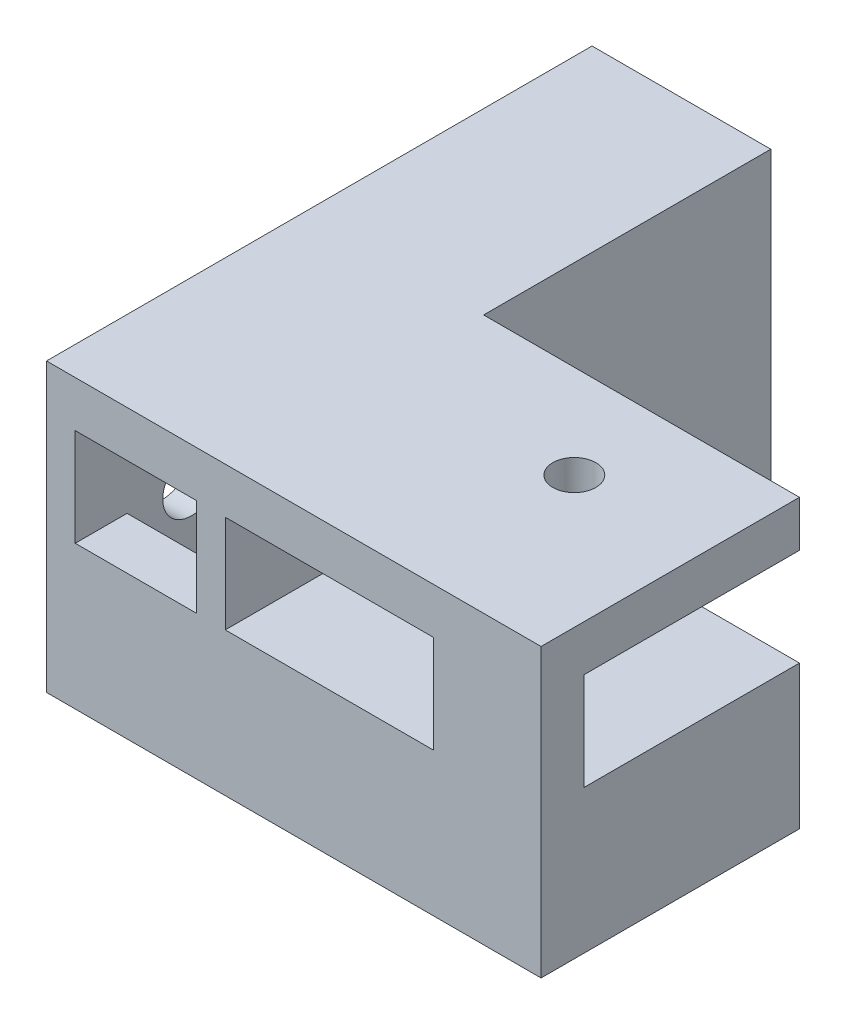
ISO-10303-21;
HEADER;
FILE_DESCRIPTION(('STEP AP214'),'2;1');
FILE_NAME('part.step','',(''),(''),'','','');
FILE_SCHEMA(('AUTOMOTIVE_DESIGN { 1 0 10303 214 1 1 1 1 }'));
ENDSEC;
DATA;
#1=APPLICATION_CONTEXT('core data for automotive mechanical design processes');
#2=APPLICATION_PROTOCOL_DEFINITION('international standard','automotive_design',2000,#1);
#3=PRODUCT_CONTEXT('',#1,'mechanical');
#4=PRODUCT('Part','Part','',(#3));
#5=PRODUCT_RELATED_PRODUCT_CATEGORY('part','',(#4));
#6=PRODUCT_DEFINITION_FORMATION('','',#4);
#7=PRODUCT_DEFINITION_CONTEXT('part definition',#1,'design');
#8=PRODUCT_DEFINITION('design','',#6,#7);
#9=PRODUCT_DEFINITION_SHAPE('','',#8);
#10=(LENGTH_UNIT() NAMED_UNIT(*) SI_UNIT(.MILLI.,.METRE.));
#11=(NAMED_UNIT(*) PLANE_ANGLE_UNIT() SI_UNIT($,.RADIAN.));
#12=(NAMED_UNIT(*) SI_UNIT($,.STERADIAN.) SOLID_ANGLE_UNIT());
#13=UNCERTAINTY_MEASURE_WITH_UNIT(LENGTH_MEASURE(1.E-05),#10,'distance_accuracy_value','');
#14=(GEOMETRIC_REPRESENTATION_CONTEXT(3) GLOBAL_UNCERTAINTY_ASSIGNED_CONTEXT((#13)) GLOBAL_UNIT_ASSIGNED_CONTEXT((#10,
#11,#12)) REPRESENTATION_CONTEXT('',''));
#15=CARTESIAN_POINT('',(0.,0.,0.));
#16=DIRECTION('',(0.,0.,1.));
#17=DIRECTION('',(1.,0.,0.));
#18=AXIS2_PLACEMENT_3D('',#15,#16,#17);
#19=CARTESIAN_POINT('',(0.,5.,-18.));
#20=DIRECTION('',(0.,1.,0.));
#21=DIRECTION('',(0.,0.,1.));
#22=AXIS2_PLACEMENT_3D('',#19,#20,#21);
#23=PLANE('',#22);
#24=DIRECTION('',(-1.,0.,0.));
#25=VECTOR('',#24,1.);
#26=CARTESIAN_POINT('',(0.,5.,-15.9436413169626));
#27=LINE('',#26,#25);
#28=CARTESIAN_POINT('',(-4.375,4.99999999986514,-15.9436413171899));
#29=VERTEX_POINT('',#28);
#30=CARTESIAN_POINT('',(-12.825,4.99999999995493,-15.9436413170386));
#31=VERTEX_POINT('',#30);
#32=EDGE_CURVE('E281',#29,#31,#27,.T.);
#33=ORIENTED_EDGE('',*,*,#32,.F.);
#34=DIRECTION('',(0.,0.,1.));
#35=VECTOR('',#34,1.);
#36=CARTESIAN_POINT('',(-4.37500000000001,5.,-38.));
#37=LINE('',#36,#35);
#38=CARTESIAN_POINT('',(-4.375,5.,-38.));
#39=VERTEX_POINT('',#38);
#40=EDGE_CURVE('E252',#39,#29,#37,.T.);
#41=ORIENTED_EDGE('',*,*,#40,.F.);
#42=DIRECTION('',(-1.,0.,0.));
#43=VECTOR('',#42,1.);
#44=CARTESIAN_POINT('',(0.,5.,-38.));
#45=LINE('',#44,#43);
#46=CARTESIAN_POINT('',(-12.825,5.,-38.));
#47=VERTEX_POINT('',#46);
#48=EDGE_CURVE('E453',#39,#47,#45,.T.);
#49=ORIENTED_EDGE('',*,*,#48,.T.);
#50=DIRECTION('',(0.,0.,-1.));
#51=VECTOR('',#50,1.);
#52=CARTESIAN_POINT('',(-12.825,5.,-38.));
#53=LINE('',#52,#51);
#54=EDGE_CURVE('E314',#31,#47,#53,.T.);
#55=ORIENTED_EDGE('',*,*,#54,.F.);
#56=EDGE_LOOP('',(#33,#41,#49,#55));
#57=FACE_BOUND('',#56,.T.);
#58=ADVANCED_FACE('F40',(#57),#23,.T.);
#59=CARTESIAN_POINT('',(10.44201924,5.,-11.5));
#60=DIRECTION('',(0.,1.,0.));
#61=DIRECTION('',(0.,0.,1.));
#62=AXIS2_PLACEMENT_3D('',#59,#60,#61);
#63=CIRCLE('',#62,1.5);
#64=CARTESIAN_POINT('',(10.44201924,5.,-10.));
#65=VERTEX_POINT('',#64);
#66=EDGE_CURVE('E401',#65,#65,#63,.F.);
#67=ORIENTED_EDGE('',*,*,#66,.T.);
#68=EDGE_LOOP('',(#67));
#69=FACE_BOUND('',#68,.T.);
#70=DIRECTION('',(0.,0.,1.));
#71=VECTOR('',#70,1.);
#72=CARTESIAN_POINT('',(12.125,4.99999999999545,0.));
#73=LINE('',#72,#71);
#74=CARTESIAN_POINT('',(12.125,4.99999999999545,-3.));
#75=VERTEX_POINT('',#74);
#76=CARTESIAN_POINT('',(12.125,4.99999999999545,0.));
#77=VERTEX_POINT('',#76);
#78=EDGE_CURVE('E311',#75,#77,#73,.T.);
#79=ORIENTED_EDGE('',*,*,#78,.F.);
#80=DIRECTION('',(-1.,0.,0.));
#81=VECTOR('',#80,1.);
#82=CARTESIAN_POINT('',(19.625,4.99999999999545,-3.));
#83=LINE('',#82,#81);
#84=CARTESIAN_POINT('',(19.625,4.99999999999545,-3.));
#85=VERTEX_POINT('',#84);
#86=EDGE_CURVE('E308',#85,#75,#83,.T.);
#87=ORIENTED_EDGE('',*,*,#86,.F.);
#88=DIRECTION('',(0.,0.,1.));
#89=VECTOR('',#88,1.);
#90=CARTESIAN_POINT('',(19.625,5.,0.));
#91=LINE('',#90,#89);
#92=CARTESIAN_POINT('',(19.625,5.,-18.));
#93=VERTEX_POINT('',#92);
#94=EDGE_CURVE('E417',#93,#85,#91,.T.);
#95=ORIENTED_EDGE('',*,*,#94,.F.);
#96=DIRECTION('',(-1.,0.,0.));
#97=VECTOR('',#96,1.);
#98=CARTESIAN_POINT('',(0.,5.,-18.));
#99=LINE('',#98,#97);
#100=CARTESIAN_POINT('',(-2.375,5.,-18.));
#101=VERTEX_POINT('',#100);
#102=EDGE_CURVE('E641',#93,#101,#99,.T.);
#103=ORIENTED_EDGE('',*,*,#102,.T.);
#104=DIRECTION('',(0.,0.,-1.));
#105=VECTOR('',#104,1.);
#106=CARTESIAN_POINT('',(-2.37500000000001,5.,-38.));
#107=LINE('',#106,#105);
#108=CARTESIAN_POINT('',(-2.375,5.,0.));
#109=VERTEX_POINT('',#108);
#110=EDGE_CURVE('E392',#109,#101,#107,.T.);
#111=ORIENTED_EDGE('',*,*,#110,.F.);
#112=DIRECTION('',(-1.,0.,0.));
#113=VECTOR('',#112,1.);
#114=CARTESIAN_POINT('',(0.,5.,0.));
#115=LINE('',#114,#113);
#116=EDGE_CURVE('E651',#77,#109,#115,.T.);
#117=ORIENTED_EDGE('',*,*,#116,.F.);
#118=EDGE_LOOP('',(#79,#87,#95,#103,#111,#117));
#119=FACE_BOUND('',#118,.T.);
#120=ADVANCED_FACE('F513',(#69,#119),#23,.T.);
#121=CARTESIAN_POINT('',(0.,11.8,-18.));
#122=DIRECTION('',(0.,1.,0.));
#123=DIRECTION('',(0.,0.,1.));
#124=AXIS2_PLACEMENT_3D('',#121,#122,#123);
#125=PLANE('',#124);
#126=CARTESIAN_POINT('',(10.44201924,11.8,-11.5));
#127=DIRECTION('',(0.,1.,0.));
#128=DIRECTION('',(0.,0.,1.));
#129=AXIS2_PLACEMENT_3D('',#126,#127,#128);
#130=CIRCLE('',#129,1.5);
#131=CARTESIAN_POINT('',(10.44201924,11.8,-10.));
#132=VERTEX_POINT('',#131);
#133=EDGE_CURVE('E333',#132,#132,#130,.F.);
#134=ORIENTED_EDGE('',*,*,#133,.F.);
#135=EDGE_LOOP('',(#134));
#136=FACE_BOUND('',#135,.T.);
#137=DIRECTION('',(1.,0.,0.));
#138=VECTOR('',#137,1.);
#139=CARTESIAN_POINT('',(19.625,11.8,-3.));
#140=LINE('',#139,#138);
#141=CARTESIAN_POINT('',(12.125,11.8,-3.));
#142=VERTEX_POINT('',#141);
#143=CARTESIAN_POINT('',(19.625,11.8,-3.));
#144=VERTEX_POINT('',#143);
#145=EDGE_CURVE('E62',#142,#144,#140,.T.);
#146=ORIENTED_EDGE('',*,*,#145,.F.);
#147=DIRECTION('',(0.,0.,-1.));
#148=VECTOR('',#147,1.);
#149=CARTESIAN_POINT('',(12.125,11.8,0.));
#150=LINE('',#149,#148);
#151=CARTESIAN_POINT('',(12.125,11.8,0.));
#152=VERTEX_POINT('',#151);
#153=EDGE_CURVE('E293',#152,#142,#150,.T.);
#154=ORIENTED_EDGE('',*,*,#153,.F.);
#155=DIRECTION('',(-1.,0.,0.));
#156=VECTOR('',#155,1.);
#157=CARTESIAN_POINT('',(0.,11.8,0.));
#158=LINE('',#157,#156);
#159=CARTESIAN_POINT('',(-2.375,11.7999999999938,0.));
#160=VERTEX_POINT('',#159);
#161=EDGE_CURVE('E600',#152,#160,#158,.T.);
#162=ORIENTED_EDGE('',*,*,#161,.T.);
#163=DIRECTION('',(0.,0.,-1.));
#164=VECTOR('',#163,1.);
#165=CARTESIAN_POINT('',(-2.37500000000001,11.7999999999938,-38.));
#166=LINE('',#165,#164);
#167=CARTESIAN_POINT('',(-2.375,11.7999999999938,-18.));
#168=VERTEX_POINT('',#167);
#169=EDGE_CURVE('E375',#160,#168,#166,.T.);
#170=ORIENTED_EDGE('',*,*,#169,.T.);
#171=DIRECTION('',(-1.,0.,0.));
#172=VECTOR('',#171,1.);
#173=CARTESIAN_POINT('',(0.,11.8,-18.));
#174=LINE('',#173,#172);
#175=CARTESIAN_POINT('',(19.625,11.8,-18.));
#176=VERTEX_POINT('',#175);
#177=EDGE_CURVE('E599',#176,#168,#174,.T.);
#178=ORIENTED_EDGE('',*,*,#177,.F.);
#179=DIRECTION('',(0.,0.,-1.));
#180=VECTOR('',#179,1.);
#181=CARTESIAN_POINT('',(19.625,11.8,0.));
#182=LINE('',#181,#180);
#183=EDGE_CURVE('E337',#144,#176,#182,.T.);
#184=ORIENTED_EDGE('',*,*,#183,.F.);
#185=EDGE_LOOP('',(#146,#154,#162,#170,#178,#184));
#186=FACE_BOUND('',#185,.T.);
#187=ADVANCED_FACE('F517',(#136,#186),#125,.F.);
#188=DIRECTION('',(-1.,0.,0.));
#189=VECTOR('',#188,1.);
#190=CARTESIAN_POINT('',(11.4417453763892,5.,-3.61207246935829));
#191=LINE('',#190,#189);
#192=CARTESIAN_POINT('',(-12.825,5.,-3.61207246935829));
#193=VERTEX_POINT('',#192);
#194=CARTESIAN_POINT('',(-4.375,5.,-3.61207246935829));
#195=VERTEX_POINT('',#194);
#196=EDGE_CURVE('E278',#193,#195,#191,.F.);
#197=ORIENTED_EDGE('',*,*,#196,.F.);
#198=CARTESIAN_POINT('',(-12.825,5.,0.));
#199=VERTEX_POINT('',#198);
#200=EDGE_CURVE('E73',#199,#193,#53,.T.);
#201=ORIENTED_EDGE('',*,*,#200,.F.);
#202=CARTESIAN_POINT('',(-4.375,5.,0.));
#203=VERTEX_POINT('',#202);
#204=EDGE_CURVE('E462',#203,#199,#115,.T.);
#205=ORIENTED_EDGE('',*,*,#204,.F.);
#206=EDGE_CURVE('E44',#195,#203,#37,.T.);
#207=ORIENTED_EDGE('',*,*,#206,.F.);
#208=EDGE_LOOP('',(#197,#201,#205,#207));
#209=FACE_BOUND('',#208,.T.);
#210=ADVANCED_FACE('F42',(#209),#23,.T.);
#211=DIRECTION('',(0.,0.,-1.));
#212=VECTOR('',#211,1.);
#213=CARTESIAN_POINT('',(-12.825,11.7999999999938,-38.));
#214=LINE('',#213,#212);
#215=CARTESIAN_POINT('',(-12.825,11.7999999999938,0.));
#216=VERTEX_POINT('',#215);
#217=CARTESIAN_POINT('',(-12.825,11.7999999999938,-38.));
#218=VERTEX_POINT('',#217);
#219=EDGE_CURVE('E322',#216,#218,#214,.T.);
#220=ORIENTED_EDGE('',*,*,#219,.T.);
#221=DIRECTION('',(-1.,0.,0.));
#222=VECTOR('',#221,1.);
#223=CARTESIAN_POINT('',(0.,11.8,-38.));
#224=LINE('',#223,#222);
#225=CARTESIAN_POINT('',(-4.37500000000001,11.7999999999938,-38.));
#226=VERTEX_POINT('',#225);
#227=EDGE_CURVE('E348',#226,#218,#224,.T.);
#228=ORIENTED_EDGE('',*,*,#227,.F.);
#229=DIRECTION('',(0.,0.,1.));
#230=VECTOR('',#229,1.);
#231=CARTESIAN_POINT('',(-4.37500000000001,11.7999999999938,-38.));
#232=LINE('',#231,#230);
#233=CARTESIAN_POINT('',(-4.375,11.8,0.));
#234=VERTEX_POINT('',#233);
#235=EDGE_CURVE('E387',#226,#234,#232,.T.);
#236=ORIENTED_EDGE('',*,*,#235,.T.);
#237=EDGE_CURVE('E357',#234,#216,#158,.T.);
#238=ORIENTED_EDGE('',*,*,#237,.T.);
#239=EDGE_LOOP('',(#220,#228,#236,#238));
#240=FACE_BOUND('',#239,.T.);
#241=ADVANCED_FACE('F480',(#240),#125,.F.);
#242=CARTESIAN_POINT('',(0.,-2.,-38.));
#243=DIRECTION('',(0.,-1.,0.));
#244=DIRECTION('',(0.,0.,-1.));
#245=AXIS2_PLACEMENT_3D('',#242,#243,#244);
#246=PLANE('',#245);
#247=DIRECTION('',(0.,0.,1.));
#248=VECTOR('',#247,1.);
#249=CARTESIAN_POINT('',(-9.825,-2.,-38.));
#250=LINE('',#249,#248);
#251=CARTESIAN_POINT('',(-9.825,-2.,-38.));
#252=VERTEX_POINT('',#251);
#253=CARTESIAN_POINT('',(-9.825,-2.,-10.));
#254=VERTEX_POINT('',#253);
#255=EDGE_CURVE('E485',#252,#254,#250,.T.);
#256=ORIENTED_EDGE('',*,*,#255,.T.);
#257=DIRECTION('',(1.,0.,0.));
#258=VECTOR('',#257,1.);
#259=CARTESIAN_POINT('',(0.,-2.,-10.));
#260=LINE('',#259,#258);
#261=CARTESIAN_POINT('',(-14.825,-2.,-10.));
#262=VERTEX_POINT('',#261);
#263=EDGE_CURVE('E425',#262,#254,#260,.T.);
#264=ORIENTED_EDGE('',*,*,#263,.F.);
#265=DIRECTION('',(0.,0.,1.));
#266=VECTOR('',#265,1.);
#267=CARTESIAN_POINT('',(-14.825,-2.,-38.));
#268=LINE('',#267,#266);
#269=CARTESIAN_POINT('',(-14.825,-2.,-38.));
#270=VERTEX_POINT('',#269);
#271=EDGE_CURVE('E624',#270,#262,#268,.T.);
#272=ORIENTED_EDGE('',*,*,#271,.F.);
#273=DIRECTION('',(1.,0.,0.));
#274=VECTOR('',#273,1.);
#275=CARTESIAN_POINT('',(0.,-2.,-38.));
#276=LINE('',#275,#274);
#277=EDGE_CURVE('E439',#270,#252,#276,.T.);
#278=ORIENTED_EDGE('',*,*,#277,.T.);
#279=EDGE_LOOP('',(#256,#264,#272,#278));
#280=FACE_BOUND('',#279,.T.);
#281=ADVANCED_FACE('F524',(#280),#246,.T.);
#282=CARTESIAN_POINT('',(-9.825,0.,-38.));
#283=DIRECTION('',(-1.,0.,0.));
#284=DIRECTION('',(0.,0.,1.));
#285=AXIS2_PLACEMENT_3D('',#282,#283,#284);
#286=PLANE('',#285);
#287=DIRECTION('',(0.,0.,1.));
#288=VECTOR('',#287,1.);
#289=CARTESIAN_POINT('',(-9.825,-5.,-38.));
#290=LINE('',#289,#288);
#291=CARTESIAN_POINT('',(-9.825,-5.,-38.));
#292=VERTEX_POINT('',#291);
#293=CARTESIAN_POINT('',(-9.825,-5.,-10.));
#294=VERTEX_POINT('',#293);
#295=EDGE_CURVE('E487',#292,#294,#290,.T.);
#296=ORIENTED_EDGE('',*,*,#295,.T.);
#297=DIRECTION('',(0.,-1.,0.));
#298=VECTOR('',#297,1.);
#299=CARTESIAN_POINT('',(-9.825,0.,-10.));
#300=LINE('',#299,#298);
#301=EDGE_CURVE('E421',#254,#294,#300,.T.);
#302=ORIENTED_EDGE('',*,*,#301,.F.);
#303=ORIENTED_EDGE('',*,*,#255,.F.);
#304=DIRECTION('',(0.,-1.,0.));
#305=VECTOR('',#304,1.);
#306=CARTESIAN_POINT('',(-9.825,0.,-38.));
#307=LINE('',#306,#305);
#308=EDGE_CURVE('E443',#252,#292,#307,.T.);
#309=ORIENTED_EDGE('',*,*,#308,.T.);
#310=EDGE_LOOP('',(#296,#302,#303,#309));
#311=FACE_BOUND('',#310,.T.);
#312=ADVANCED_FACE('F688',(#311),#286,.T.);
#313=CARTESIAN_POINT('',(0.,-5.,-18.));
#314=DIRECTION('',(0.,1.,0.));
#315=DIRECTION('',(-1.,0.,0.));
#316=AXIS2_PLACEMENT_3D('',#313,#314,#315);
#317=PLANE('',#316);
#318=CARTESIAN_POINT('',(10.44201924,-5.,-11.5));
#319=DIRECTION('',(0.,1.,0.));
#320=DIRECTION('',(-1.,0.,0.));
#321=AXIS2_PLACEMENT_3D('',#318,#319,#320);
#322=CIRCLE('',#321,1.5);
#323=CARTESIAN_POINT('',(8.94201924000001,-5.,-11.5));
#324=VERTEX_POINT('',#323);
#325=EDGE_CURVE('E397',#324,#324,#322,.F.);
#326=ORIENTED_EDGE('',*,*,#325,.F.);
#327=EDGE_LOOP('',(#326));
#328=FACE_BOUND('',#327,.T.);
#329=DIRECTION('',(-1.,0.,0.));
#330=VECTOR('',#329,1.);
#331=CARTESIAN_POINT('',(0.,-5.,0.));
#332=LINE('',#331,#330);
#333=CARTESIAN_POINT('',(19.625,-5.,0.));
#334=VERTEX_POINT('',#333);
#335=CARTESIAN_POINT('',(-14.825,-5.,0.));
#336=VERTEX_POINT('',#335);
#337=EDGE_CURVE('E592',#334,#336,#332,.T.);
#338=ORIENTED_EDGE('',*,*,#337,.T.);
#339=DIRECTION('',(0.,0.,1.));
#340=VECTOR('',#339,1.);
#341=CARTESIAN_POINT('',(-14.825,-5.,-10.));
#342=LINE('',#341,#340);
#343=CARTESIAN_POINT('',(-14.825,-5.,-10.));
#344=VERTEX_POINT('',#343);
#345=EDGE_CURVE('E434',#344,#336,#342,.T.);
#346=ORIENTED_EDGE('',*,*,#345,.F.);
#347=DIRECTION('',(-1.,0.,0.));
#348=VECTOR('',#347,1.);
#349=CARTESIAN_POINT('',(0.,-5.,-10.));
#350=LINE('',#349,#348);
#351=EDGE_CURVE('E431',#294,#344,#350,.T.);
#352=ORIENTED_EDGE('',*,*,#351,.F.);
#353=ORIENTED_EDGE('',*,*,#295,.F.);
#354=DIRECTION('',(-1.,0.,0.));
#355=VECTOR('',#354,1.);
#356=CARTESIAN_POINT('',(0.,-5.,-38.));
#357=LINE('',#356,#355);
#358=CARTESIAN_POINT('',(-2.375,-5.,-38.));
#359=VERTEX_POINT('',#358);
#360=EDGE_CURVE('E447',#359,#292,#357,.T.);
#361=ORIENTED_EDGE('',*,*,#360,.F.);
#362=DIRECTION('',(0.,0.,1.));
#363=VECTOR('',#362,1.);
#364=CARTESIAN_POINT('',(-2.375,-5.,-38.));
#365=LINE('',#364,#363);
#366=CARTESIAN_POINT('',(-2.375,-5.,-18.));
#367=VERTEX_POINT('',#366);
#368=EDGE_CURVE('E628',#359,#367,#365,.T.);
#369=ORIENTED_EDGE('',*,*,#368,.T.);
#370=DIRECTION('',(-1.,0.,0.));
#371=VECTOR('',#370,1.);
#372=CARTESIAN_POINT('',(0.,-5.,-18.));
#373=LINE('',#372,#371);
#374=CARTESIAN_POINT('',(19.625,-5.,-18.));
#375=VERTEX_POINT('',#374);
#376=EDGE_CURVE('E11',#375,#367,#373,.T.);
#377=ORIENTED_EDGE('',*,*,#376,.F.);
#378=DIRECTION('',(0.,0.,-1.));
#379=VECTOR('',#378,1.);
#380=CARTESIAN_POINT('',(19.625,-5.,0.));
#381=LINE('',#380,#379);
#382=EDGE_CURVE('E409',#334,#375,#381,.T.);
#383=ORIENTED_EDGE('',*,*,#382,.F.);
#384=EDGE_LOOP('',(#338,#346,#352,#353,#361,#369,#377,#383));
#385=FACE_BOUND('',#384,.T.);
#386=ADVANCED_FACE('F675',(#328,#385),#317,.F.);
#387=CARTESIAN_POINT('',(0.,0.,-18.));
#388=DIRECTION('',(0.,0.,1.));
#389=DIRECTION('',(1.,0.,0.));
#390=AXIS2_PLACEMENT_3D('',#387,#388,#389);
#391=PLANE('',#390);
#392=ORIENTED_EDGE('',*,*,#102,.F.);
#393=DIRECTION('',(0.,1.,0.));
#394=VECTOR('',#393,1.);
#395=CARTESIAN_POINT('',(19.625,5.,-18.));
#396=LINE('',#395,#394);
#397=EDGE_CURVE('E413',#375,#93,#396,.T.);
#398=ORIENTED_EDGE('',*,*,#397,.F.);
#399=ORIENTED_EDGE('',*,*,#376,.T.);
#400=DIRECTION('',(0.,-1.,0.));
#401=VECTOR('',#400,1.);
#402=CARTESIAN_POINT('',(-2.375,0.,-18.));
#403=LINE('',#402,#401);
#404=EDGE_CURVE('E51',#101,#367,#403,.T.);
#405=ORIENTED_EDGE('',*,*,#404,.F.);
#406=EDGE_LOOP('',(#392,#398,#399,#405));
#407=FACE_BOUND('',#406,.T.);
#408=ADVANCED_FACE('F672',(#407),#391,.F.);
#409=CARTESIAN_POINT('',(0.,0.,0.));
#410=DIRECTION('',(0.,0.,1.));
#411=DIRECTION('',(1.,0.,0.));
#412=AXIS2_PLACEMENT_3D('',#409,#410,#411);
#413=PLANE('',#412);
#414=DIRECTION('',(0.,1.,0.));
#415=VECTOR('',#414,1.);
#416=CARTESIAN_POINT('',(12.125,-500000.,0.));
#417=LINE('',#416,#415);
#418=EDGE_CURVE('E305',#77,#152,#417,.T.);
#419=ORIENTED_EDGE('',*,*,#418,.F.);
#420=ORIENTED_EDGE('',*,*,#116,.T.);
#421=DIRECTION('',(0.,-1.,0.));
#422=VECTOR('',#421,1.);
#423=CARTESIAN_POINT('',(-2.37500000005515,500000.,0.));
#424=LINE('',#423,#422);
#425=EDGE_CURVE('E369',#160,#109,#424,.T.);
#426=ORIENTED_EDGE('',*,*,#425,.F.);
#427=ORIENTED_EDGE('',*,*,#161,.F.);
#428=EDGE_LOOP('',(#419,#420,#426,#427));
#429=FACE_BOUND('',#428,.T.);
#430=ORIENTED_EDGE('',*,*,#204,.T.);
#431=DIRECTION('',(0.,-1.,0.));
#432=VECTOR('',#431,1.);
#433=CARTESIAN_POINT('',(-12.8250000000552,500000.,0.));
#434=LINE('',#433,#432);
#435=EDGE_CURVE('E318',#216,#199,#434,.T.);
#436=ORIENTED_EDGE('',*,*,#435,.F.);
#437=ORIENTED_EDGE('',*,*,#237,.F.);
#438=DIRECTION('',(0.,-1.,0.));
#439=VECTOR('',#438,1.);
#440=CARTESIAN_POINT('',(-4.37500000005515,500000.,0.));
#441=LINE('',#440,#439);
#442=EDGE_CURVE('E376',#234,#203,#441,.T.);
#443=ORIENTED_EDGE('',*,*,#442,.T.);
#444=EDGE_LOOP('',(#430,#436,#437,#443));
#445=FACE_BOUND('',#444,.T.);
#446=DIRECTION('',(0.,-1.,0.));
#447=VECTOR('',#446,1.);
#448=CARTESIAN_POINT('',(19.625,5.,0.));
#449=LINE('',#448,#447);
#450=CARTESIAN_POINT('',(19.625,15.,0.));
#451=VERTEX_POINT('',#450);
#452=EDGE_CURVE('E405',#451,#334,#449,.T.);
#453=ORIENTED_EDGE('',*,*,#452,.F.);
#454=DIRECTION('',(-1.,0.,0.));
#455=VECTOR('',#454,1.);
#456=CARTESIAN_POINT('',(0.,15.,0.));
#457=LINE('',#456,#455);
#458=CARTESIAN_POINT('',(-14.825,15.,0.));
#459=VERTEX_POINT('',#458);
#460=EDGE_CURVE('E589',#451,#459,#457,.T.);
#461=ORIENTED_EDGE('',*,*,#460,.T.);
#462=DIRECTION('',(0.,1.,0.));
#463=VECTOR('',#462,1.);
#464=CARTESIAN_POINT('',(-14.825,0.,0.));
#465=LINE('',#464,#463);
#466=EDGE_CURVE('E438',#336,#459,#465,.T.);
#467=ORIENTED_EDGE('',*,*,#466,.F.);
#468=ORIENTED_EDGE('',*,*,#337,.F.);
#469=EDGE_LOOP('',(#453,#461,#467,#468));
#470=FACE_BOUND('',#469,.T.);
#471=ADVANCED_FACE('F471',(#429,#445,#470),#413,.T.);
#472=CARTESIAN_POINT('',(-2.375,0.,-38.));
#473=DIRECTION('',(-1.,0.,0.));
#474=DIRECTION('',(0.,-1.,0.));
#475=AXIS2_PLACEMENT_3D('',#472,#473,#474);
#476=PLANE('',#475);
#477=DIRECTION('',(0.,-1.,0.));
#478=VECTOR('',#477,1.);
#479=CARTESIAN_POINT('',(-2.375,0.,-38.));
#480=LINE('',#479,#478);
#481=CARTESIAN_POINT('',(-2.375,15.,-38.));
#482=VERTEX_POINT('',#481);
#483=EDGE_CURVE('E450',#482,#359,#480,.T.);
#484=ORIENTED_EDGE('',*,*,#483,.F.);
#485=DIRECTION('',(0.,0.,1.));
#486=VECTOR('',#485,1.);
#487=CARTESIAN_POINT('',(-2.375,15.,-38.));
#488=LINE('',#487,#486);
#489=CARTESIAN_POINT('',(-2.375,15.,-18.));
#490=VERTEX_POINT('',#489);
#491=EDGE_CURVE('E483',#482,#490,#488,.T.);
#492=ORIENTED_EDGE('',*,*,#491,.T.);
#493=DIRECTION('',(0.,1.,0.));
#494=VECTOR('',#493,1.);
#495=CARTESIAN_POINT('',(-2.375,0.,-18.));
#496=LINE('',#495,#494);
#497=EDGE_CURVE('E396',#168,#490,#496,.T.);
#498=ORIENTED_EDGE('',*,*,#497,.F.);
#499=ORIENTED_EDGE('',*,*,#169,.F.);
#500=ORIENTED_EDGE('',*,*,#425,.T.);
#501=ORIENTED_EDGE('',*,*,#110,.T.);
#502=ORIENTED_EDGE('',*,*,#404,.T.);
#503=ORIENTED_EDGE('',*,*,#368,.F.);
#504=EDGE_LOOP('',(#484,#492,#498,#499,#500,#501,#502,#503));
#505=FACE_BOUND('',#504,.T.);
#506=ADVANCED_FACE('F509',(#505),#476,.F.);
#507=CARTESIAN_POINT('',(-14.825,0.,-38.));
#508=DIRECTION('',(1.,0.,0.));
#509=DIRECTION('',(0.,0.,-1.));
#510=AXIS2_PLACEMENT_3D('',#507,#508,#509);
#511=PLANE('',#510);
#512=CARTESIAN_POINT('',(-14.825,4.60953503060943,-8.09510014133165));
#513=DIRECTION('',(-1.,0.,0.));
#514=DIRECTION('',(0.,-1.,0.));
#515=AXIS2_PLACEMENT_3D('',#512,#513,#514);
#516=CIRCLE('',#515,2.);
#517=CARTESIAN_POINT('',(-14.825,2.60953503060943,-8.09510014133165));
#518=VERTEX_POINT('',#517);
#519=EDGE_CURVE('E285',#518,#518,#516,.T.);
#520=ORIENTED_EDGE('',*,*,#519,.F.);
#521=EDGE_LOOP('',(#520));
#522=FACE_BOUND('',#521,.T.);
#523=ORIENTED_EDGE('',*,*,#466,.T.);
#524=DIRECTION('',(0.,0.,1.));
#525=VECTOR('',#524,1.);
#526=CARTESIAN_POINT('',(-14.825,15.,-38.));
#527=LINE('',#526,#525);
#528=CARTESIAN_POINT('',(-14.825,15.,-38.));
#529=VERTEX_POINT('',#528);
#530=EDGE_CURVE('E597',#529,#459,#527,.T.);
#531=ORIENTED_EDGE('',*,*,#530,.F.);
#532=DIRECTION('',(0.,1.,0.));
#533=VECTOR('',#532,1.);
#534=CARTESIAN_POINT('',(-14.825,0.,-38.));
#535=LINE('',#534,#533);
#536=EDGE_CURVE('E456',#270,#529,#535,.T.);
#537=ORIENTED_EDGE('',*,*,#536,.F.);
#538=ORIENTED_EDGE('',*,*,#271,.T.);
#539=DIRECTION('',(0.,1.,0.));
#540=VECTOR('',#539,1.);
#541=CARTESIAN_POINT('',(-14.825,0.,-10.));
#542=LINE('',#541,#540);
#543=EDGE_CURVE('E428',#344,#262,#542,.T.);
#544=ORIENTED_EDGE('',*,*,#543,.F.);
#545=ORIENTED_EDGE('',*,*,#345,.T.);
#546=EDGE_LOOP('',(#523,#531,#537,#538,#544,#545));
#547=FACE_BOUND('',#546,.T.);
#548=ADVANCED_FACE('F499',(#522,#547),#511,.F.);
#549=CARTESIAN_POINT('',(0.,0.,-38.));
#550=DIRECTION('',(0.,0.,1.));
#551=DIRECTION('',(1.,0.,0.));
#552=AXIS2_PLACEMENT_3D('',#549,#550,#551);
#553=PLANE('',#552);
#554=ORIENTED_EDGE('',*,*,#536,.T.);
#555=DIRECTION('',(-1.,0.,0.));
#556=VECTOR('',#555,1.);
#557=CARTESIAN_POINT('',(0.,15.,-38.));
#558=LINE('',#557,#556);
#559=EDGE_CURVE('E351',#482,#529,#558,.T.);
#560=ORIENTED_EDGE('',*,*,#559,.F.);
#561=ORIENTED_EDGE('',*,*,#483,.T.);
#562=ORIENTED_EDGE('',*,*,#360,.T.);
#563=ORIENTED_EDGE('',*,*,#308,.F.);
#564=ORIENTED_EDGE('',*,*,#277,.F.);
#565=EDGE_LOOP('',(#554,#560,#561,#562,#563,#564));
#566=FACE_BOUND('',#565,.T.);
#567=DIRECTION('',(0.,-1.,0.));
#568=VECTOR('',#567,1.);
#569=CARTESIAN_POINT('',(-12.8250000000552,500000.,-38.));
#570=LINE('',#569,#568);
#571=EDGE_CURVE('E317',#218,#47,#570,.T.);
#572=ORIENTED_EDGE('',*,*,#571,.T.);
#573=ORIENTED_EDGE('',*,*,#48,.F.);
#574=DIRECTION('',(0.,-1.,0.));
#575=VECTOR('',#574,1.);
#576=CARTESIAN_POINT('',(-4.37500000005517,500000.,-38.));
#577=LINE('',#576,#575);
#578=EDGE_CURVE('E372',#226,#39,#577,.T.);
#579=ORIENTED_EDGE('',*,*,#578,.F.);
#580=ORIENTED_EDGE('',*,*,#227,.T.);
#581=EDGE_LOOP('',(#572,#573,#579,#580));
#582=FACE_BOUND('',#581,.T.);
#583=ADVANCED_FACE('F496',(#566,#582),#553,.F.);
#584=CARTESIAN_POINT('',(0.,0.,-10.));
#585=DIRECTION('',(0.,0.,1.));
#586=DIRECTION('',(1.,0.,0.));
#587=AXIS2_PLACEMENT_3D('',#584,#585,#586);
#588=PLANE('',#587);
#589=ORIENTED_EDGE('',*,*,#301,.T.);
#590=ORIENTED_EDGE('',*,*,#351,.T.);
#591=ORIENTED_EDGE('',*,*,#543,.T.);
#592=ORIENTED_EDGE('',*,*,#263,.T.);
#593=EDGE_LOOP('',(#589,#590,#591,#592));
#594=FACE_BOUND('',#593,.T.);
#595=ADVANCED_FACE('F498',(#594),#588,.F.);
#596=CARTESIAN_POINT('',(19.625,0.,0.));
#597=DIRECTION('',(1.,0.,0.));
#598=DIRECTION('',(0.,0.,-1.));
#599=AXIS2_PLACEMENT_3D('',#596,#597,#598);
#600=PLANE('',#599);
#601=ORIENTED_EDGE('',*,*,#452,.T.);
#602=ORIENTED_EDGE('',*,*,#382,.T.);
#603=ORIENTED_EDGE('',*,*,#397,.T.);
#604=ORIENTED_EDGE('',*,*,#94,.T.);
#605=DIRECTION('',(0.,1.,0.));
#606=VECTOR('',#605,1.);
#607=CARTESIAN_POINT('',(19.625,-500000.,-3.));
#608=LINE('',#607,#606);
#609=EDGE_CURVE('E297',#85,#144,#608,.T.);
#610=ORIENTED_EDGE('',*,*,#609,.T.);
#611=ORIENTED_EDGE('',*,*,#183,.T.);
#612=DIRECTION('',(0.,1.,0.));
#613=VECTOR('',#612,1.);
#614=CARTESIAN_POINT('',(19.625,15.,-18.));
#615=LINE('',#614,#613);
#616=CARTESIAN_POINT('',(19.625,15.,-18.));
#617=VERTEX_POINT('',#616);
#618=EDGE_CURVE('E340',#176,#617,#615,.T.);
#619=ORIENTED_EDGE('',*,*,#618,.T.);
#620=DIRECTION('',(0.,0.,1.));
#621=VECTOR('',#620,1.);
#622=CARTESIAN_POINT('',(19.625,15.,0.));
#623=LINE('',#622,#621);
#624=EDGE_CURVE('E344',#617,#451,#623,.T.);
#625=ORIENTED_EDGE('',*,*,#624,.T.);
#626=EDGE_LOOP('',(#601,#602,#603,#604,#610,#611,#619,#625));
#627=FACE_BOUND('',#626,.T.);
#628=ADVANCED_FACE('F506',(#627),#600,.T.);
#629=CARTESIAN_POINT('',(10.44201924,19.2426406871193,-11.5));
#630=DIRECTION('',(0.,-1.,0.));
#631=DIRECTION('',(1.,0.,0.));
#632=AXIS2_PLACEMENT_3D('',#629,#630,#631);
#633=CYLINDRICAL_SURFACE('',#632,1.5);
#634=ORIENTED_EDGE('',*,*,#66,.F.);
#635=EDGE_LOOP('',(#634));
#636=FACE_BOUND('',#635,.T.);
#637=ORIENTED_EDGE('',*,*,#325,.T.);
#638=EDGE_LOOP('',(#637));
#639=FACE_BOUND('',#638,.T.);
#640=ADVANCED_FACE('F576',(#636,#639),#633,.F.);
#641=CARTESIAN_POINT('',(-4.37500000005517,500000.,-38.));
#642=DIRECTION('',(1.,0.,0.));
#643=DIRECTION('',(0.,0.,-1.));
#644=AXIS2_PLACEMENT_3D('',#641,#642,#643);
#645=PLANE('',#644);
#646=ORIENTED_EDGE('',*,*,#40,.T.);
#647=DIRECTION('',(0.,-0.510338679358111,-0.859973506772749));
#648=VECTOR('',#647,1.);
#649=CARTESIAN_POINT('',(-4.375,10.695081489774,-6.34683943183492));
#650=LINE('',#649,#648);
#651=CARTESIAN_POINT('',(-4.37499999999999,4.60953503060943,-16.6016152126922));
#652=VERTEX_POINT('',#651);
#653=EDGE_CURVE('E246',#29,#652,#650,.T.);
#654=ORIENTED_EDGE('',*,*,#653,.T.);
#655=DIRECTION('',(0.,-0.510338679358111,0.859973506772749));
#656=VECTOR('',#655,1.);
#657=CARTESIAN_POINT('',(-4.375,-3.87707736384501,-2.30079476408421));
#658=LINE('',#657,#656);
#659=CARTESIAN_POINT('',(-4.375,0.271522618915901,-9.29161521269217));
#660=VERTEX_POINT('',#659);
#661=EDGE_CURVE('E250',#652,#660,#658,.T.);
#662=ORIENTED_EDGE('',*,*,#661,.T.);
#663=CARTESIAN_POINT('',(-4.375,4.60953503060943,-8.09510014133165));
#664=DIRECTION('',(1.,0.,0.));
#665=DIRECTION('',(0.,0.,-1.));
#666=AXIS2_PLACEMENT_3D('',#663,#664,#665);
#667=CIRCLE('',#666,4.5);
#668=EDGE_CURVE('E282',#660,#195,#667,.F.);
#669=ORIENTED_EDGE('',*,*,#668,.T.);
#670=ORIENTED_EDGE('',*,*,#206,.T.);
#671=ORIENTED_EDGE('',*,*,#442,.F.);
#672=ORIENTED_EDGE('',*,*,#235,.F.);
#673=ORIENTED_EDGE('',*,*,#578,.T.);
#674=EDGE_LOOP('',(#646,#654,#662,#669,#670,#671,#672,#673));
#675=FACE_BOUND('',#674,.T.);
#676=ADVANCED_FACE('F248',(#675),#645,.F.);
#677=CARTESIAN_POINT('',(0.,15.,-18.));
#678=DIRECTION('',(0.,1.,0.));
#679=DIRECTION('',(-1.,0.,0.));
#680=AXIS2_PLACEMENT_3D('',#677,#678,#679);
#681=PLANE('',#680);
#682=CARTESIAN_POINT('',(10.44201924,15.,-11.5));
#683=DIRECTION('',(0.,1.,0.));
#684=DIRECTION('',(-1.,0.,0.));
#685=AXIS2_PLACEMENT_3D('',#682,#683,#684);
#686=CIRCLE('',#685,1.5);
#687=CARTESIAN_POINT('',(8.94201924,15.,-11.5));
#688=VERTEX_POINT('',#687);
#689=EDGE_CURVE('E329',#688,#688,#686,.T.);
#690=ORIENTED_EDGE('',*,*,#689,.F.);
#691=EDGE_LOOP('',(#690));
#692=FACE_BOUND('',#691,.T.);
#693=ORIENTED_EDGE('',*,*,#460,.F.);
#694=ORIENTED_EDGE('',*,*,#624,.F.);
#695=DIRECTION('',(-1.,0.,0.));
#696=VECTOR('',#695,1.);
#697=CARTESIAN_POINT('',(0.,15.,-18.));
#698=LINE('',#697,#696);
#699=EDGE_CURVE('E604',#617,#490,#698,.T.);
#700=ORIENTED_EDGE('',*,*,#699,.T.);
#701=ORIENTED_EDGE('',*,*,#491,.F.);
#702=ORIENTED_EDGE('',*,*,#559,.T.);
#703=ORIENTED_EDGE('',*,*,#530,.T.);
#704=EDGE_LOOP('',(#693,#694,#700,#701,#702,#703));
#705=FACE_BOUND('',#704,.T.);
#706=ADVANCED_FACE('F569',(#692,#705),#681,.T.);
#707=CARTESIAN_POINT('',(0.,0.,-18.));
#708=DIRECTION('',(0.,0.,1.));
#709=DIRECTION('',(1.,0.,0.));
#710=AXIS2_PLACEMENT_3D('',#707,#708,#709);
#711=PLANE('',#710);
#712=ORIENTED_EDGE('',*,*,#177,.T.);
#713=ORIENTED_EDGE('',*,*,#497,.T.);
#714=ORIENTED_EDGE('',*,*,#699,.F.);
#715=ORIENTED_EDGE('',*,*,#618,.F.);
#716=EDGE_LOOP('',(#712,#713,#714,#715));
#717=FACE_BOUND('',#716,.T.);
#718=ADVANCED_FACE('F565',(#717),#711,.F.);
#719=CARTESIAN_POINT('',(10.44201924,19.2426406871193,-11.5));
#720=DIRECTION('',(0.,-1.,0.));
#721=DIRECTION('',(1.,0.,0.));
#722=AXIS2_PLACEMENT_3D('',#719,#720,#721);
#723=CYLINDRICAL_SURFACE('',#722,1.5);
#724=ORIENTED_EDGE('',*,*,#689,.T.);
#725=EDGE_LOOP('',(#724));
#726=FACE_BOUND('',#725,.T.);
#727=ORIENTED_EDGE('',*,*,#133,.T.);
#728=EDGE_LOOP('',(#727));
#729=FACE_BOUND('',#728,.T.);
#730=ADVANCED_FACE('F562',(#726,#729),#723,.F.);
#731=CARTESIAN_POINT('',(-12.8250000000552,500000.,-38.));
#732=DIRECTION('',(-1.,0.,0.));
#733=DIRECTION('',(0.,-1.,0.));
#734=AXIS2_PLACEMENT_3D('',#731,#732,#733);
#735=PLANE('',#734);
#736=DIRECTION('',(0.,-0.510338679358111,-0.859973506772749));
#737=VECTOR('',#736,1.);
#738=CARTESIAN_POINT('',(-12.825,10.695081489774,-6.34683943183492));
#739=LINE('',#738,#737);
#740=CARTESIAN_POINT('',(-12.825,4.60953503060943,-16.6016152126922));
#741=VERTEX_POINT('',#740);
#742=EDGE_CURVE('E271',#31,#741,#739,.T.);
#743=ORIENTED_EDGE('',*,*,#742,.F.);
#744=ORIENTED_EDGE('',*,*,#54,.T.);
#745=ORIENTED_EDGE('',*,*,#571,.F.);
#746=ORIENTED_EDGE('',*,*,#219,.F.);
#747=ORIENTED_EDGE('',*,*,#435,.T.);
#748=ORIENTED_EDGE('',*,*,#200,.T.);
#749=CARTESIAN_POINT('',(-12.825,4.60953503060943,-8.09510014133165));
#750=DIRECTION('',(-1.,0.,0.));
#751=DIRECTION('',(0.,-1.,0.));
#752=AXIS2_PLACEMENT_3D('',#749,#750,#751);
#753=CIRCLE('',#752,4.5);
#754=CARTESIAN_POINT('',(-12.825,0.271522618915901,-9.29161521269217));
#755=VERTEX_POINT('',#754);
#756=EDGE_CURVE('E529',#755,#193,#753,.T.);
#757=ORIENTED_EDGE('',*,*,#756,.F.);
#758=DIRECTION('',(0.,-0.510338679358111,0.859973506772749));
#759=VECTOR('',#758,1.);
#760=CARTESIAN_POINT('',(-12.825,-3.87707736384501,-2.30079476408422));
#761=LINE('',#760,#759);
#762=EDGE_CURVE('E258',#741,#755,#761,.T.);
#763=ORIENTED_EDGE('',*,*,#762,.F.);
#764=EDGE_LOOP('',(#743,#744,#745,#746,#747,#748,#757,#763));
#765=FACE_BOUND('',#764,.T.);
#766=CARTESIAN_POINT('',(-12.825,4.60953503060943,-8.09510014133165));
#767=DIRECTION('',(-1.,0.,0.));
#768=DIRECTION('',(0.,-1.,0.));
#769=AXIS2_PLACEMENT_3D('',#766,#767,#768);
#770=CIRCLE('',#769,2.);
#771=CARTESIAN_POINT('',(-12.825,2.60953503060943,-8.09510014133165));
#772=VERTEX_POINT('',#771);
#773=EDGE_CURVE('E286',#772,#772,#770,.T.);
#774=ORIENTED_EDGE('',*,*,#773,.T.);
#775=EDGE_LOOP('',(#774));
#776=FACE_BOUND('',#775,.T.);
#777=ADVANCED_FACE('F491',(#765,#776),#735,.F.);
#778=CARTESIAN_POINT('',(19.625,-500000.,-3.));
#779=DIRECTION('',(0.,0.,1.));
#780=DIRECTION('',(1.,0.,0.));
#781=AXIS2_PLACEMENT_3D('',#778,#779,#780);
#782=PLANE('',#781);
#783=ORIENTED_EDGE('',*,*,#609,.F.);
#784=ORIENTED_EDGE('',*,*,#86,.T.);
#785=DIRECTION('',(0.,1.,0.));
#786=VECTOR('',#785,1.);
#787=CARTESIAN_POINT('',(12.125,-500000.,-3.));
#788=LINE('',#787,#786);
#789=EDGE_CURVE('E302',#75,#142,#788,.T.);
#790=ORIENTED_EDGE('',*,*,#789,.T.);
#791=ORIENTED_EDGE('',*,*,#145,.T.);
#792=EDGE_LOOP('',(#783,#784,#790,#791));
#793=FACE_BOUND('',#792,.T.);
#794=ADVANCED_FACE('F554',(#793),#782,.F.);
#795=CARTESIAN_POINT('',(12.125,-500000.,0.));
#796=DIRECTION('',(1.,0.,0.));
#797=DIRECTION('',(0.,0.,-1.));
#798=AXIS2_PLACEMENT_3D('',#795,#796,#797);
#799=PLANE('',#798);
#800=ORIENTED_EDGE('',*,*,#789,.F.);
#801=ORIENTED_EDGE('',*,*,#78,.T.);
#802=ORIENTED_EDGE('',*,*,#418,.T.);
#803=ORIENTED_EDGE('',*,*,#153,.T.);
#804=EDGE_LOOP('',(#800,#801,#802,#803));
#805=FACE_BOUND('',#804,.T.);
#806=ADVANCED_FACE('F552',(#805),#799,.F.);
#807=CARTESIAN_POINT('',(-12.825,4.60953503060943,-8.09510014133165));
#808=DIRECTION('',(-1.,0.,0.));
#809=DIRECTION('',(0.,-1.,0.));
#810=AXIS2_PLACEMENT_3D('',#807,#808,#809);
#811=CYLINDRICAL_SURFACE('',#810,2.);
#812=ORIENTED_EDGE('',*,*,#773,.F.);
#813=EDGE_LOOP('',(#812));
#814=FACE_BOUND('',#813,.T.);
#815=ORIENTED_EDGE('',*,*,#519,.T.);
#816=EDGE_LOOP('',(#815));
#817=FACE_BOUND('',#816,.T.);
#818=ADVANCED_FACE('F549',(#814,#817),#811,.F.);
#819=CARTESIAN_POINT('',(11.4417453763892,10.695081489774,-6.34683943183492));
#820=DIRECTION('',(0.,0.859973506772749,-0.510338679358111));
#821=DIRECTION('',(0.,0.510338679358111,0.859973506772749));
#822=AXIS2_PLACEMENT_3D('',#819,#820,#821);
#823=PLANE('',#822);
#824=ORIENTED_EDGE('',*,*,#32,.T.);
#825=ORIENTED_EDGE('',*,*,#742,.T.);
#826=DIRECTION('',(-1.,0.,0.));
#827=VECTOR('',#826,1.);
#828=CARTESIAN_POINT('',(11.4417453763892,4.60953503060943,-16.6016152126922));
#829=LINE('',#828,#827);
#830=EDGE_CURVE('E257',#652,#741,#829,.T.);
#831=ORIENTED_EDGE('',*,*,#830,.F.);
#832=ORIENTED_EDGE('',*,*,#653,.F.);
#833=EDGE_LOOP('',(#824,#825,#831,#832));
#834=FACE_BOUND('',#833,.T.);
#835=ADVANCED_FACE('F269',(#834),#823,.F.);
#836=CARTESIAN_POINT('',(11.4417453763892,-3.87707736384501,-2.30079476408422));
#837=DIRECTION('',(0.,-0.859973506772749,-0.510338679358111));
#838=DIRECTION('',(0.,0.510338679358111,-0.859973506772749));
#839=AXIS2_PLACEMENT_3D('',#836,#837,#838);
#840=PLANE('',#839);
#841=ORIENTED_EDGE('',*,*,#830,.T.);
#842=ORIENTED_EDGE('',*,*,#762,.T.);
#843=DIRECTION('',(-1.,0.,0.));
#844=VECTOR('',#843,1.);
#845=CARTESIAN_POINT('',(11.4417453763892,0.271522618915901,-9.29161521269217));
#846=LINE('',#845,#844);
#847=EDGE_CURVE('E266',#660,#755,#846,.T.);
#848=ORIENTED_EDGE('',*,*,#847,.F.);
#849=ORIENTED_EDGE('',*,*,#661,.F.);
#850=EDGE_LOOP('',(#841,#842,#848,#849));
#851=FACE_BOUND('',#850,.T.);
#852=ADVANCED_FACE('F263',(#851),#840,.F.);
#853=CARTESIAN_POINT('',(11.4417453763892,4.60953503060943,-8.09510014133165));
#854=DIRECTION('',(-1.,0.,0.));
#855=DIRECTION('',(0.,0.,1.));
#856=AXIS2_PLACEMENT_3D('',#853,#854,#855);
#857=CYLINDRICAL_SURFACE('',#856,4.5);
#858=ORIENTED_EDGE('',*,*,#196,.T.);
#859=ORIENTED_EDGE('',*,*,#668,.F.);
#860=ORIENTED_EDGE('',*,*,#847,.T.);
#861=ORIENTED_EDGE('',*,*,#756,.T.);
#862=EDGE_LOOP('',(#858,#859,#860,#861));
#863=FACE_BOUND('',#862,.T.);
#864=ADVANCED_FACE('F539',(#863),#857,.F.);
#865=CLOSED_SHELL('',(#58,#120,#187,#210,#241,#281,#312,#386,#408,#471,#506,#548,#583,#595,#628,
#640,#676,#706,#718,#730,#777,#794,#806,#818,#835,#852,#864));
#866=MANIFOLD_SOLID_BREP('B2',#865);
#867=ADVANCED_BREP_SHAPE_REPRESENTATION('',(#18,#866),#14);
#868=SHAPE_DEFINITION_REPRESENTATION(#9,#867);
ENDSEC;
END-ISO-10303-21;
